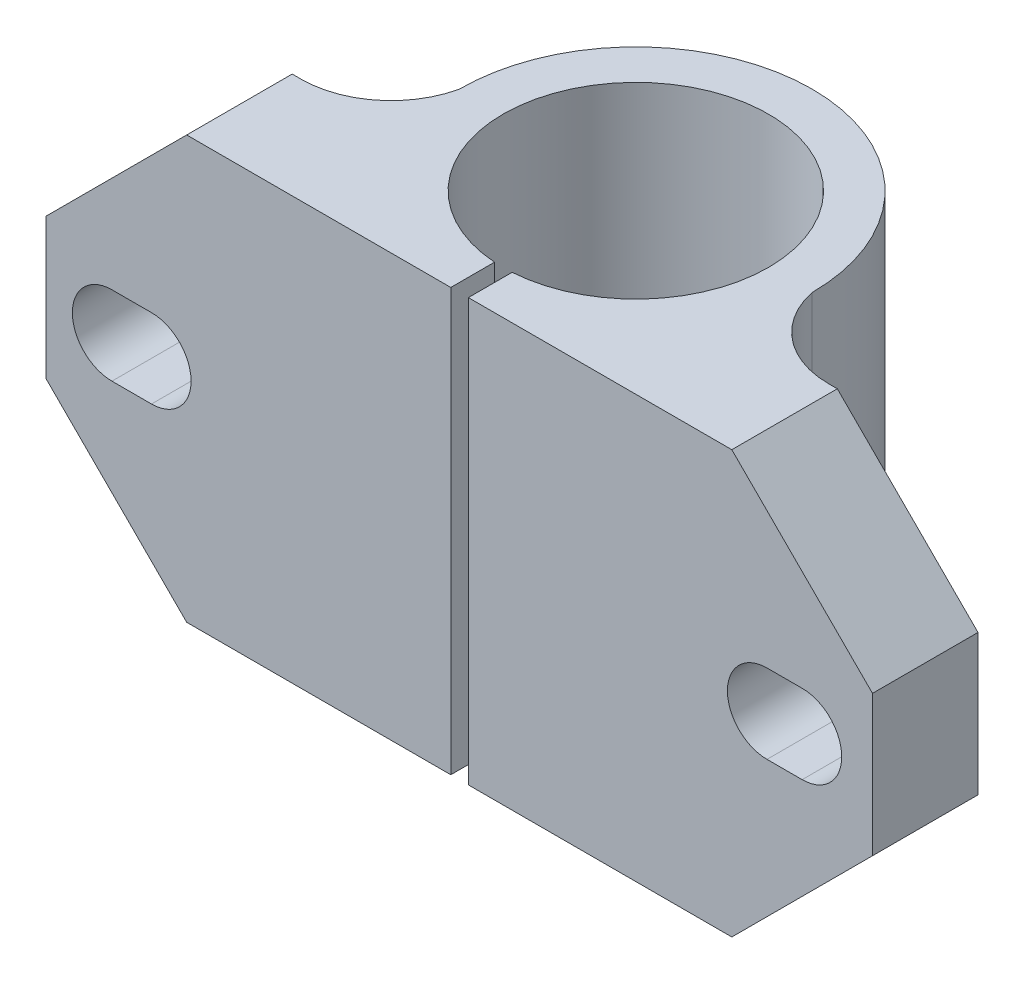
ISO-10303-21;
HEADER;
FILE_DESCRIPTION(('STEP AP214'),'2;1');
FILE_NAME('part.step','',(''),(''),'','','');
FILE_SCHEMA(('AUTOMOTIVE_DESIGN { 1 0 10303 214 1 1 1 1 }'));
ENDSEC;
DATA;
#1=APPLICATION_CONTEXT('core data for automotive mechanical design processes');
#2=APPLICATION_PROTOCOL_DEFINITION('international standard','automotive_design',2000,#1);
#3=PRODUCT_CONTEXT('',#1,'mechanical');
#4=PRODUCT('Part','Part','',(#3));
#5=PRODUCT_RELATED_PRODUCT_CATEGORY('part','',(#4));
#6=PRODUCT_DEFINITION_FORMATION('','',#4);
#7=PRODUCT_DEFINITION_CONTEXT('part definition',#1,'design');
#8=PRODUCT_DEFINITION('design','',#6,#7);
#9=PRODUCT_DEFINITION_SHAPE('','',#8);
#10=(LENGTH_UNIT() NAMED_UNIT(*) SI_UNIT(.MILLI.,.METRE.));
#11=(NAMED_UNIT(*) PLANE_ANGLE_UNIT() SI_UNIT($,.RADIAN.));
#12=(NAMED_UNIT(*) SI_UNIT($,.STERADIAN.) SOLID_ANGLE_UNIT());
#13=UNCERTAINTY_MEASURE_WITH_UNIT(LENGTH_MEASURE(1.E-05),#10,'distance_accuracy_value','');
#14=(GEOMETRIC_REPRESENTATION_CONTEXT(3) GLOBAL_UNCERTAINTY_ASSIGNED_CONTEXT((#13)) GLOBAL_UNIT_ASSIGNED_CONTEXT((#10,
#11,#12)) REPRESENTATION_CONTEXT('',''));
#15=CARTESIAN_POINT('',(0.,0.,0.));
#16=DIRECTION('',(0.,0.,1.));
#17=DIRECTION('',(1.,0.,0.));
#18=AXIS2_PLACEMENT_3D('',#15,#16,#17);
#19=CARTESIAN_POINT('',(0.,0.,0.));
#20=DIRECTION('',(0.,0.,1.));
#21=DIRECTION('',(1.,0.,0.));
#22=AXIS2_PLACEMENT_3D('',#19,#20,#21);
#23=PLANE('',#22);
#24=DIRECTION('',(-1.,0.,0.));
#25=VECTOR('',#24,1.);
#26=CARTESIAN_POINT('',(41.,14.25,0.));
#27=LINE('',#26,#25);
#28=CARTESIAN_POINT('',(43.,14.25,0.));
#29=VERTEX_POINT('',#28);
#30=CARTESIAN_POINT('',(41.,14.25,0.));
#31=VERTEX_POINT('',#30);
#32=EDGE_CURVE('E357',#29,#31,#27,.T.);
#33=ORIENTED_EDGE('',*,*,#32,.F.);
#34=CARTESIAN_POINT('',(43.,12.,0.));
#35=DIRECTION('',(0.,0.,1.));
#36=DIRECTION('',(1.,0.,0.));
#37=AXIS2_PLACEMENT_3D('',#34,#35,#36);
#38=CIRCLE('',#37,2.25);
#39=CARTESIAN_POINT('',(43.,9.74999999999999,0.));
#40=VERTEX_POINT('',#39);
#41=EDGE_CURVE('E373',#40,#29,#38,.T.);
#42=ORIENTED_EDGE('',*,*,#41,.F.);
#43=DIRECTION('',(1.,0.,0.));
#44=VECTOR('',#43,1.);
#45=CARTESIAN_POINT('',(41.,9.75000000000001,0.));
#46=LINE('',#45,#44);
#47=CARTESIAN_POINT('',(41.,9.75000000000001,0.));
#48=VERTEX_POINT('',#47);
#49=EDGE_CURVE('E376',#48,#40,#46,.T.);
#50=ORIENTED_EDGE('',*,*,#49,.F.);
#51=CARTESIAN_POINT('',(41.,12.,0.));
#52=DIRECTION('',(0.,0.,1.));
#53=DIRECTION('',(1.,0.,0.));
#54=AXIS2_PLACEMENT_3D('',#51,#52,#53);
#55=CIRCLE('',#54,2.25);
#56=EDGE_CURVE('E378',#31,#48,#55,.T.);
#57=ORIENTED_EDGE('',*,*,#56,.F.);
#58=EDGE_LOOP('',(#33,#42,#50,#57));
#59=FACE_BOUND('',#58,.T.);
#60=DIRECTION('',(1.,0.,0.));
#61=VECTOR('',#60,1.);
#62=CARTESIAN_POINT('',(0.,0.,0.));
#63=LINE('',#62,#61);
#64=CARTESIAN_POINT('',(24.0186333106229,0.,0.));
#65=VERTEX_POINT('',#64);
#66=CARTESIAN_POINT('',(38.9999999999999,0.,0.));
#67=VERTEX_POINT('',#66);
#68=EDGE_CURVE('E254',#65,#67,#63,.T.);
#69=ORIENTED_EDGE('',*,*,#68,.T.);
#70=DIRECTION('',(-0.707106781186549,-0.707106781186546,0.));
#71=VECTOR('',#70,1.);
#72=CARTESIAN_POINT('',(19.4999999999999,-19.5,0.));
#73=LINE('',#72,#71);
#74=CARTESIAN_POINT('',(47.,8.,0.));
#75=VERTEX_POINT('',#74);
#76=EDGE_CURVE('E331',#67,#75,#73,.F.);
#77=ORIENTED_EDGE('',*,*,#76,.T.);
#78=DIRECTION('',(0.,1.,0.));
#79=VECTOR('',#78,1.);
#80=CARTESIAN_POINT('',(47.,0.,0.));
#81=LINE('',#80,#79);
#82=CARTESIAN_POINT('',(47.,16.,0.));
#83=VERTEX_POINT('',#82);
#84=EDGE_CURVE('E301',#75,#83,#81,.T.);
#85=ORIENTED_EDGE('',*,*,#84,.T.);
#86=DIRECTION('',(-0.707106781186546,0.707106781186549,0.));
#87=VECTOR('',#86,1.);
#88=CARTESIAN_POINT('',(31.5000000000001,31.4999999999999,0.));
#89=LINE('',#88,#87);
#90=CARTESIAN_POINT('',(39.,24.,0.));
#91=VERTEX_POINT('',#90);
#92=EDGE_CURVE('E59',#83,#91,#89,.T.);
#93=ORIENTED_EDGE('',*,*,#92,.T.);
#94=DIRECTION('',(1.,0.,0.));
#95=VECTOR('',#94,1.);
#96=CARTESIAN_POINT('',(0.,24.,0.));
#97=LINE('',#96,#95);
#98=CARTESIAN_POINT('',(24.0186333106229,24.,0.));
#99=VERTEX_POINT('',#98);
#100=EDGE_CURVE('E243',#99,#91,#97,.T.);
#101=ORIENTED_EDGE('',*,*,#100,.F.);
#102=DIRECTION('',(0.,-1.,0.));
#103=VECTOR('',#102,1.);
#104=CARTESIAN_POINT('',(24.0186333106229,24.,0.));
#105=LINE('',#104,#103);
#106=EDGE_CURVE('E236',#99,#65,#105,.T.);
#107=ORIENTED_EDGE('',*,*,#106,.T.);
#108=EDGE_LOOP('',(#69,#77,#85,#93,#101,#107));
#109=FACE_BOUND('',#108,.T.);
#110=ADVANCED_FACE('F36',(#59,#109),#23,.T.);
#111=CARTESIAN_POINT('',(0.,0.,-6.));
#112=DIRECTION('',(-1.,0.,0.));
#113=DIRECTION('',(0.,0.,1.));
#114=AXIS2_PLACEMENT_3D('',#111,#112,#113);
#115=PLANE('',#114);
#116=DIRECTION('',(0.,1.,0.));
#117=VECTOR('',#116,1.);
#118=CARTESIAN_POINT('',(0.,0.,-6.));
#119=LINE('',#118,#117);
#120=CARTESIAN_POINT('',(0.,8.,-6.));
#121=VERTEX_POINT('',#120);
#122=CARTESIAN_POINT('',(0.,16.,-6.));
#123=VERTEX_POINT('',#122);
#124=EDGE_CURVE('E285',#121,#123,#119,.T.);
#125=ORIENTED_EDGE('',*,*,#124,.F.);
#126=DIRECTION('',(0.,0.,1.));
#127=VECTOR('',#126,1.);
#128=CARTESIAN_POINT('',(0.,8.,-6.));
#129=LINE('',#128,#127);
#130=CARTESIAN_POINT('',(0.,8.,0.));
#131=VERTEX_POINT('',#130);
#132=EDGE_CURVE('E306',#121,#131,#129,.T.);
#133=ORIENTED_EDGE('',*,*,#132,.T.);
#134=DIRECTION('',(0.,1.,0.));
#135=VECTOR('',#134,1.);
#136=CARTESIAN_POINT('',(0.,0.,0.));
#137=LINE('',#136,#135);
#138=CARTESIAN_POINT('',(0.,16.,0.));
#139=VERTEX_POINT('',#138);
#140=EDGE_CURVE('E268',#131,#139,#137,.T.);
#141=ORIENTED_EDGE('',*,*,#140,.T.);
#142=DIRECTION('',(0.,0.,-1.));
#143=VECTOR('',#142,1.);
#144=CARTESIAN_POINT('',(0.,16.,-6.));
#145=LINE('',#144,#143);
#146=EDGE_CURVE('E288',#139,#123,#145,.T.);
#147=ORIENTED_EDGE('',*,*,#146,.T.);
#148=EDGE_LOOP('',(#125,#133,#141,#147));
#149=FACE_BOUND('',#148,.T.);
#150=ADVANCED_FACE('F403',(#149),#115,.T.);
#151=CARTESIAN_POINT('',(8.50000000000001,0.,-6.));
#152=DIRECTION('',(0.,0.,-1.));
#153=DIRECTION('',(-1.,0.,0.));
#154=AXIS2_PLACEMENT_3D('',#151,#152,#153);
#155=PLANE('',#154);
#156=DIRECTION('',(-1.,0.,0.));
#157=VECTOR('',#156,1.);
#158=CARTESIAN_POINT('',(8.50000000000001,9.75000000000001,-6.));
#159=LINE('',#158,#157);
#160=CARTESIAN_POINT('',(6.,9.75000000000001,-6.00000000000001));
#161=VERTEX_POINT('',#160);
#162=CARTESIAN_POINT('',(3.74999999999994,9.75000000000001,-6.00000000000001));
#163=VERTEX_POINT('',#162);
#164=EDGE_CURVE('E382',#161,#163,#159,.T.);
#165=ORIENTED_EDGE('',*,*,#164,.F.);
#166=CARTESIAN_POINT('',(6.,12.,-6.00000000000001));
#167=DIRECTION('',(0.,0.,-1.));
#168=DIRECTION('',(-1.,0.,0.));
#169=AXIS2_PLACEMENT_3D('',#166,#167,#168);
#170=CIRCLE('',#169,2.25000000000007);
#171=CARTESIAN_POINT('',(6.,14.2500000000001,-6.00000000000001));
#172=VERTEX_POINT('',#171);
#173=EDGE_CURVE('E218',#172,#161,#170,.T.);
#174=ORIENTED_EDGE('',*,*,#173,.F.);
#175=DIRECTION('',(1.,0.,0.));
#176=VECTOR('',#175,1.);
#177=CARTESIAN_POINT('',(8.5,14.25,-6.));
#178=LINE('',#177,#176);
#179=CARTESIAN_POINT('',(3.74999999999994,14.25,-6.00000000000001));
#180=VERTEX_POINT('',#179);
#181=EDGE_CURVE('E51',#180,#172,#178,.T.);
#182=ORIENTED_EDGE('',*,*,#181,.F.);
#183=CARTESIAN_POINT('',(3.74999999999994,12.,-6.));
#184=DIRECTION('',(0.,0.,-1.));
#185=DIRECTION('',(-1.,0.,0.));
#186=AXIS2_PLACEMENT_3D('',#183,#184,#185);
#187=CIRCLE('',#186,2.25);
#188=EDGE_CURVE('E380',#163,#180,#187,.T.);
#189=ORIENTED_EDGE('',*,*,#188,.F.);
#190=EDGE_LOOP('',(#165,#174,#182,#189));
#191=FACE_BOUND('',#190,.T.);
#192=DIRECTION('',(-1.,0.,0.));
#193=VECTOR('',#192,1.);
#194=CARTESIAN_POINT('',(8.50000000000001,0.,-6.));
#195=LINE('',#194,#193);
#196=CARTESIAN_POINT('',(8.50000000000001,0.,-6.00000000000002));
#197=VERTEX_POINT('',#196);
#198=CARTESIAN_POINT('',(8.00000000000003,0.,-6.));
#199=VERTEX_POINT('',#198);
#200=EDGE_CURVE('E265',#197,#199,#195,.T.);
#201=ORIENTED_EDGE('',*,*,#200,.T.);
#202=DIRECTION('',(0.707106781186549,-0.707106781186546,0.));
#203=VECTOR('',#202,1.);
#204=CARTESIAN_POINT('',(8.25000000000002,-0.249999999999996,-6.));
#205=LINE('',#204,#203);
#206=EDGE_CURVE('E319',#199,#121,#205,.F.);
#207=ORIENTED_EDGE('',*,*,#206,.T.);
#208=ORIENTED_EDGE('',*,*,#124,.T.);
#209=DIRECTION('',(0.707106781186546,0.707106781186549,0.));
#210=VECTOR('',#209,1.);
#211=CARTESIAN_POINT('',(-3.75,12.25,-6.));
#212=LINE('',#211,#210);
#213=CARTESIAN_POINT('',(8.,24.,-6.));
#214=VERTEX_POINT('',#213);
#215=EDGE_CURVE('E317',#123,#214,#212,.T.);
#216=ORIENTED_EDGE('',*,*,#215,.T.);
#217=DIRECTION('',(-1.,0.,0.));
#218=VECTOR('',#217,1.);
#219=CARTESIAN_POINT('',(8.50000000000001,24.,-6.));
#220=LINE('',#219,#218);
#221=CARTESIAN_POINT('',(8.50000000000001,24.,-6.00000000000002));
#222=VERTEX_POINT('',#221);
#223=EDGE_CURVE('E282',#222,#214,#220,.T.);
#224=ORIENTED_EDGE('',*,*,#223,.F.);
#225=DIRECTION('',(0.,1.,0.));
#226=VECTOR('',#225,1.);
#227=CARTESIAN_POINT('',(8.50000000000001,0.,-6.00000000000002));
#228=LINE('',#227,#226);
#229=EDGE_CURVE('E289',#197,#222,#228,.T.);
#230=ORIENTED_EDGE('',*,*,#229,.F.);
#231=EDGE_LOOP('',(#201,#207,#208,#216,#224,#230));
#232=FACE_BOUND('',#231,.T.);
#233=ADVANCED_FACE('F399',(#191,#232),#155,.T.);
#234=CARTESIAN_POINT('',(8.50000000000001,0.,-11.1210427356607));
#235=DIRECTION('',(0.,1.,0.));
#236=DIRECTION('',(0.,0.,1.));
#237=AXIS2_PLACEMENT_3D('',#234,#235,#236);
#238=CYLINDRICAL_SURFACE('',#237,5.12104273566066);
#239=CARTESIAN_POINT('',(8.50000000000001,24.,-11.1210427356607));
#240=DIRECTION('',(0.,-1.,0.));
#241=DIRECTION('',(0.,0.,-1.));
#242=AXIS2_PLACEMENT_3D('',#239,#240,#241);
#243=CIRCLE('',#242,5.12104273566066);
#244=CARTESIAN_POINT('',(13.4959473897421,24.,-9.99605901160399));
#245=VERTEX_POINT('',#244);
#246=EDGE_CURVE('E279',#245,#222,#243,.T.);
#247=ORIENTED_EDGE('',*,*,#246,.F.);
#248=DIRECTION('',(0.,1.,0.));
#249=VECTOR('',#248,1.);
#250=CARTESIAN_POINT('',(13.4959473897421,0.,-9.99605901160399));
#251=LINE('',#250,#249);
#252=CARTESIAN_POINT('',(13.4959473897421,0.,-9.99605901160399));
#253=VERTEX_POINT('',#252);
#254=EDGE_CURVE('E291',#253,#245,#251,.T.);
#255=ORIENTED_EDGE('',*,*,#254,.F.);
#256=CARTESIAN_POINT('',(8.50000000000001,0.,-11.1210427356607));
#257=DIRECTION('',(0.,-1.,0.));
#258=DIRECTION('',(0.,0.,-1.));
#259=AXIS2_PLACEMENT_3D('',#256,#257,#258);
#260=CIRCLE('',#259,5.12104273566066);
#261=EDGE_CURVE('E262',#253,#197,#260,.T.);
#262=ORIENTED_EDGE('',*,*,#261,.T.);
#263=ORIENTED_EDGE('',*,*,#229,.T.);
#264=EDGE_LOOP('',(#247,#255,#262,#263));
#265=FACE_BOUND('',#264,.T.);
#266=ADVANCED_FACE('F402',(#265),#238,.F.);
#267=CARTESIAN_POINT('',(23.5186333106229,0.,-10.0227213844719));
#268=DIRECTION('',(0.,1.,0.));
#269=DIRECTION('',(0.,0.,1.));
#270=AXIS2_PLACEMENT_3D('',#267,#268,#269);
#271=CYLINDRICAL_SURFACE('',#270,10.0227213844719);
#272=CARTESIAN_POINT('',(23.5186333106229,24.,-10.0227213844719));
#273=DIRECTION('',(0.,1.,0.));
#274=DIRECTION('',(0.,0.,1.));
#275=AXIS2_PLACEMENT_3D('',#272,#273,#274);
#276=CIRCLE('',#275,10.0227213844719);
#277=CARTESIAN_POINT('',(33.5413546555968,24.,-10.021831577252));
#278=VERTEX_POINT('',#277);
#279=EDGE_CURVE('E276',#278,#245,#276,.T.);
#280=ORIENTED_EDGE('',*,*,#279,.F.);
#281=DIRECTION('',(0.,1.,0.));
#282=VECTOR('',#281,1.);
#283=CARTESIAN_POINT('',(33.5413546555968,0.,-10.021831577252));
#284=LINE('',#283,#282);
#285=CARTESIAN_POINT('',(33.5413546555968,0.,-10.021831577252));
#286=VERTEX_POINT('',#285);
#287=EDGE_CURVE('E293',#286,#278,#284,.T.);
#288=ORIENTED_EDGE('',*,*,#287,.F.);
#289=CARTESIAN_POINT('',(23.5186333106229,0.,-10.0227213844719));
#290=DIRECTION('',(0.,1.,0.));
#291=DIRECTION('',(0.,0.,1.));
#292=AXIS2_PLACEMENT_3D('',#289,#290,#291);
#293=CIRCLE('',#292,10.0227213844719);
#294=EDGE_CURVE('E259',#286,#253,#293,.T.);
#295=ORIENTED_EDGE('',*,*,#294,.T.);
#296=ORIENTED_EDGE('',*,*,#254,.T.);
#297=EDGE_LOOP('',(#280,#288,#295,#296));
#298=FACE_BOUND('',#297,.T.);
#299=ADVANCED_FACE('F435',(#298),#271,.T.);
#300=CARTESIAN_POINT('',(38.5000000000001,0.,-11.0677523541657));
#301=DIRECTION('',(0.,1.,0.));
#302=DIRECTION('',(0.,0.,1.));
#303=AXIS2_PLACEMENT_3D('',#300,#301,#302);
#304=CYLINDRICAL_SURFACE('',#303,5.06775235416579);
#305=CARTESIAN_POINT('',(38.5000000000001,24.,-11.0677523541657));
#306=DIRECTION('',(0.,-1.,0.));
#307=DIRECTION('',(0.,0.,-1.));
#308=AXIS2_PLACEMENT_3D('',#305,#306,#307);
#309=CIRCLE('',#308,5.06775235416579);
#310=CARTESIAN_POINT('',(38.5,24.,-6.00000000000001));
#311=VERTEX_POINT('',#310);
#312=EDGE_CURVE('E273',#311,#278,#309,.T.);
#313=ORIENTED_EDGE('',*,*,#312,.F.);
#314=DIRECTION('',(0.,1.,0.));
#315=VECTOR('',#314,1.);
#316=CARTESIAN_POINT('',(38.5,0.,-6.00000000000001));
#317=LINE('',#316,#315);
#318=CARTESIAN_POINT('',(38.5,0.,-6.00000000000001));
#319=VERTEX_POINT('',#318);
#320=EDGE_CURVE('E295',#319,#311,#317,.T.);
#321=ORIENTED_EDGE('',*,*,#320,.F.);
#322=CARTESIAN_POINT('',(38.5000000000001,0.,-11.0677523541657));
#323=DIRECTION('',(0.,-1.,0.));
#324=DIRECTION('',(0.,0.,-1.));
#325=AXIS2_PLACEMENT_3D('',#322,#323,#324);
#326=CIRCLE('',#325,5.06775235416579);
#327=EDGE_CURVE('E256',#319,#286,#326,.T.);
#328=ORIENTED_EDGE('',*,*,#327,.T.);
#329=ORIENTED_EDGE('',*,*,#287,.T.);
#330=EDGE_LOOP('',(#313,#321,#328,#329));
#331=FACE_BOUND('',#330,.T.);
#332=ADVANCED_FACE('F438',(#331),#304,.F.);
#333=CARTESIAN_POINT('',(47.,0.,-6.));
#334=DIRECTION('',(0.,0.,-1.));
#335=DIRECTION('',(-1.,0.,0.));
#336=AXIS2_PLACEMENT_3D('',#333,#334,#335);
#337=PLANE('',#336);
#338=CARTESIAN_POINT('',(41.,12.,-6.00000000000001));
#339=DIRECTION('',(0.,0.,-1.));
#340=DIRECTION('',(-1.,0.,0.));
#341=AXIS2_PLACEMENT_3D('',#338,#339,#340);
#342=CIRCLE('',#341,2.25);
#343=CARTESIAN_POINT('',(41.,9.75000000000001,-6.00000000000001));
#344=VERTEX_POINT('',#343);
#345=CARTESIAN_POINT('',(41.,14.25,-6.00000000000001));
#346=VERTEX_POINT('',#345);
#347=EDGE_CURVE('E206',#344,#346,#342,.T.);
#348=ORIENTED_EDGE('',*,*,#347,.F.);
#349=DIRECTION('',(-1.,0.,0.));
#350=VECTOR('',#349,1.);
#351=CARTESIAN_POINT('',(47.,9.75000000000001,-6.));
#352=LINE('',#351,#350);
#353=CARTESIAN_POINT('',(43.,9.74999999999999,-6.00000000000001));
#354=VERTEX_POINT('',#353);
#355=EDGE_CURVE('E359',#354,#344,#352,.T.);
#356=ORIENTED_EDGE('',*,*,#355,.F.);
#357=CARTESIAN_POINT('',(43.,12.,-6.00000000000001));
#358=DIRECTION('',(0.,0.,-1.));
#359=DIRECTION('',(-1.,0.,0.));
#360=AXIS2_PLACEMENT_3D('',#357,#358,#359);
#361=CIRCLE('',#360,2.25);
#362=CARTESIAN_POINT('',(43.,14.25,-6.00000000000001));
#363=VERTEX_POINT('',#362);
#364=EDGE_CURVE('E339',#363,#354,#361,.T.);
#365=ORIENTED_EDGE('',*,*,#364,.F.);
#366=DIRECTION('',(1.,0.,0.));
#367=VECTOR('',#366,1.);
#368=CARTESIAN_POINT('',(47.,14.25,-6.));
#369=LINE('',#368,#367);
#370=EDGE_CURVE('E222',#346,#363,#369,.T.);
#371=ORIENTED_EDGE('',*,*,#370,.F.);
#372=EDGE_LOOP('',(#348,#356,#365,#371));
#373=FACE_BOUND('',#372,.T.);
#374=DIRECTION('',(0.,1.,0.));
#375=VECTOR('',#374,1.);
#376=CARTESIAN_POINT('',(47.,0.,-6.));
#377=LINE('',#376,#375);
#378=CARTESIAN_POINT('',(47.,8.,-6.));
#379=VERTEX_POINT('',#378);
#380=CARTESIAN_POINT('',(47.,16.,-6.));
#381=VERTEX_POINT('',#380);
#382=EDGE_CURVE('E298',#379,#381,#377,.T.);
#383=ORIENTED_EDGE('',*,*,#382,.F.);
#384=DIRECTION('',(0.707106781186549,0.707106781186546,0.));
#385=VECTOR('',#384,1.);
#386=CARTESIAN_POINT('',(43.,4.00000000000001,-6.));
#387=LINE('',#386,#385);
#388=CARTESIAN_POINT('',(38.9999999999999,0.,-6.00000000000001));
#389=VERTEX_POINT('',#388);
#390=EDGE_CURVE('E328',#379,#389,#387,.F.);
#391=ORIENTED_EDGE('',*,*,#390,.T.);
#392=DIRECTION('',(-1.,0.,0.));
#393=VECTOR('',#392,1.);
#394=CARTESIAN_POINT('',(47.,0.,-6.));
#395=LINE('',#394,#393);
#396=EDGE_CURVE('E253',#389,#319,#395,.T.);
#397=ORIENTED_EDGE('',*,*,#396,.T.);
#398=ORIENTED_EDGE('',*,*,#320,.T.);
#399=DIRECTION('',(-1.,0.,0.));
#400=VECTOR('',#399,1.);
#401=CARTESIAN_POINT('',(47.,24.,-6.));
#402=LINE('',#401,#400);
#403=CARTESIAN_POINT('',(39.,24.,-6.00000000000001));
#404=VERTEX_POINT('',#403);
#405=EDGE_CURVE('E271',#404,#311,#402,.T.);
#406=ORIENTED_EDGE('',*,*,#405,.F.);
#407=DIRECTION('',(0.707106781186546,-0.707106781186549,0.));
#408=VECTOR('',#407,1.);
#409=CARTESIAN_POINT('',(55.,7.99999999999996,-6.));
#410=LINE('',#409,#408);
#411=EDGE_CURVE('E326',#404,#381,#410,.T.);
#412=ORIENTED_EDGE('',*,*,#411,.T.);
#413=EDGE_LOOP('',(#383,#391,#397,#398,#406,#412));
#414=FACE_BOUND('',#413,.T.);
#415=ADVANCED_FACE('F363',(#373,#414),#337,.T.);
#416=CARTESIAN_POINT('',(47.,0.,0.));
#417=DIRECTION('',(1.,0.,0.));
#418=DIRECTION('',(0.,0.,-1.));
#419=AXIS2_PLACEMENT_3D('',#416,#417,#418);
#420=PLANE('',#419);
#421=ORIENTED_EDGE('',*,*,#84,.F.);
#422=DIRECTION('',(0.,0.,-1.));
#423=VECTOR('',#422,1.);
#424=CARTESIAN_POINT('',(47.,8.,0.));
#425=LINE('',#424,#423);
#426=EDGE_CURVE('E323',#75,#379,#425,.T.);
#427=ORIENTED_EDGE('',*,*,#426,.T.);
#428=ORIENTED_EDGE('',*,*,#382,.T.);
#429=DIRECTION('',(0.,0.,1.));
#430=VECTOR('',#429,1.);
#431=CARTESIAN_POINT('',(47.,16.,0.));
#432=LINE('',#431,#430);
#433=EDGE_CURVE('E321',#381,#83,#432,.T.);
#434=ORIENTED_EDGE('',*,*,#433,.T.);
#435=EDGE_LOOP('',(#421,#427,#428,#434));
#436=FACE_BOUND('',#435,.T.);
#437=ADVANCED_FACE('F450',(#436),#420,.T.);
#438=DIRECTION('',(1.,0.,0.));
#439=VECTOR('',#438,1.);
#440=CARTESIAN_POINT('',(6.,9.75000000000001,0.));
#441=LINE('',#440,#439);
#442=CARTESIAN_POINT('',(3.74999999999994,9.75000000000001,0.));
#443=VERTEX_POINT('',#442);
#444=CARTESIAN_POINT('',(6.,9.75000000000001,0.));
#445=VERTEX_POINT('',#444);
#446=EDGE_CURVE('E388',#443,#445,#441,.T.);
#447=ORIENTED_EDGE('',*,*,#446,.F.);
#448=CARTESIAN_POINT('',(3.74999999999994,12.,0.));
#449=DIRECTION('',(0.,0.,1.));
#450=DIRECTION('',(1.,0.,0.));
#451=AXIS2_PLACEMENT_3D('',#448,#449,#450);
#452=CIRCLE('',#451,2.25);
#453=CARTESIAN_POINT('',(3.74999999999994,14.25,0.));
#454=VERTEX_POINT('',#453);
#455=EDGE_CURVE('E214',#454,#443,#452,.T.);
#456=ORIENTED_EDGE('',*,*,#455,.F.);
#457=DIRECTION('',(-1.,0.,0.));
#458=VECTOR('',#457,1.);
#459=CARTESIAN_POINT('',(6.,14.25,0.));
#460=LINE('',#459,#458);
#461=CARTESIAN_POINT('',(6.,14.25,0.));
#462=VERTEX_POINT('',#461);
#463=EDGE_CURVE('E200',#462,#454,#460,.T.);
#464=ORIENTED_EDGE('',*,*,#463,.F.);
#465=CARTESIAN_POINT('',(6.,12.,0.));
#466=DIRECTION('',(0.,0.,-1.));
#467=DIRECTION('',(-1.,0.,0.));
#468=AXIS2_PLACEMENT_3D('',#465,#466,#467);
#469=CIRCLE('',#468,2.25000000000007);
#470=EDGE_CURVE('E212',#462,#445,#469,.T.);
#471=ORIENTED_EDGE('',*,*,#470,.T.);
#472=EDGE_LOOP('',(#447,#456,#464,#471));
#473=FACE_BOUND('',#472,.T.);
#474=ORIENTED_EDGE('',*,*,#140,.F.);
#475=DIRECTION('',(-0.707106781186549,0.707106781186546,0.));
#476=VECTOR('',#475,1.);
#477=CARTESIAN_POINT('',(4.,4.00000000000001,0.));
#478=LINE('',#477,#476);
#479=CARTESIAN_POINT('',(8.00000000000002,0.,0.));
#480=VERTEX_POINT('',#479);
#481=EDGE_CURVE('E311',#131,#480,#478,.F.);
#482=ORIENTED_EDGE('',*,*,#481,.T.);
#483=CARTESIAN_POINT('',(23.0186333106229,0.,0.));
#484=VERTEX_POINT('',#483);
#485=EDGE_CURVE('E251',#480,#484,#63,.T.);
#486=ORIENTED_EDGE('',*,*,#485,.T.);
#487=DIRECTION('',(0.,-1.,0.));
#488=VECTOR('',#487,1.);
#489=CARTESIAN_POINT('',(23.0186333106229,24.,0.));
#490=LINE('',#489,#488);
#491=CARTESIAN_POINT('',(23.0186333106229,24.,0.));
#492=VERTEX_POINT('',#491);
#493=EDGE_CURVE('E246',#492,#484,#490,.T.);
#494=ORIENTED_EDGE('',*,*,#493,.F.);
#495=CARTESIAN_POINT('',(8.,24.,0.));
#496=VERTEX_POINT('',#495);
#497=EDGE_CURVE('E269',#496,#492,#97,.T.);
#498=ORIENTED_EDGE('',*,*,#497,.F.);
#499=DIRECTION('',(-0.707106781186546,-0.707106781186549,0.));
#500=VECTOR('',#499,1.);
#501=CARTESIAN_POINT('',(-7.99999999999999,7.99999999999996,0.));
#502=LINE('',#501,#500);
#503=EDGE_CURVE('E309',#496,#139,#502,.T.);
#504=ORIENTED_EDGE('',*,*,#503,.T.);
#505=EDGE_LOOP('',(#474,#482,#486,#494,#498,#504));
#506=FACE_BOUND('',#505,.T.);
#507=ADVANCED_FACE('F210',(#473,#506),#23,.T.);
#508=CARTESIAN_POINT('',(38.5000000000001,0.,-11.0677523541657));
#509=DIRECTION('',(0.,-1.,0.));
#510=DIRECTION('',(0.,0.,-1.));
#511=AXIS2_PLACEMENT_3D('',#508,#509,#510);
#512=PLANE('',#511);
#513=ORIENTED_EDGE('',*,*,#485,.F.);
#514=DIRECTION('',(0.,0.,-1.));
#515=VECTOR('',#514,1.);
#516=CARTESIAN_POINT('',(8.00000000000003,0.,-11.0677523541657));
#517=LINE('',#516,#515);
#518=EDGE_CURVE('E315',#480,#199,#517,.T.);
#519=ORIENTED_EDGE('',*,*,#518,.T.);
#520=ORIENTED_EDGE('',*,*,#200,.F.);
#521=ORIENTED_EDGE('',*,*,#261,.F.);
#522=ORIENTED_EDGE('',*,*,#294,.F.);
#523=ORIENTED_EDGE('',*,*,#327,.F.);
#524=ORIENTED_EDGE('',*,*,#396,.F.);
#525=DIRECTION('',(0.,0.,1.));
#526=VECTOR('',#525,1.);
#527=CARTESIAN_POINT('',(38.9999999999999,0.,-11.0677523541657));
#528=LINE('',#527,#526);
#529=EDGE_CURVE('E313',#389,#67,#528,.T.);
#530=ORIENTED_EDGE('',*,*,#529,.T.);
#531=ORIENTED_EDGE('',*,*,#68,.F.);
#532=DIRECTION('',(0.,0.,1.));
#533=VECTOR('',#532,1.);
#534=CARTESIAN_POINT('',(24.0186333106229,0.,-2.48929586881175));
#535=LINE('',#534,#533);
#536=CARTESIAN_POINT('',(24.0186333106229,0.,-2.48929586881175));
#537=VERTEX_POINT('',#536);
#538=EDGE_CURVE('E228',#537,#65,#535,.T.);
#539=ORIENTED_EDGE('',*,*,#538,.F.);
#540=CARTESIAN_POINT('',(23.5186333106229,0.,-10.022721384472));
#541=DIRECTION('',(0.,1.,0.));
#542=DIRECTION('',(0.,0.,1.));
#543=AXIS2_PLACEMENT_3D('',#540,#541,#542);
#544=CIRCLE('',#543,7.55000000000005);
#545=CARTESIAN_POINT('',(23.0186333106229,0.,-2.48929586881175));
#546=VERTEX_POINT('',#545);
#547=EDGE_CURVE('E220',#537,#546,#544,.T.);
#548=ORIENTED_EDGE('',*,*,#547,.T.);
#549=DIRECTION('',(0.,0.,-1.));
#550=VECTOR('',#549,1.);
#551=CARTESIAN_POINT('',(23.0186333106229,0.,0.));
#552=LINE('',#551,#550);
#553=EDGE_CURVE('E233',#484,#546,#552,.T.);
#554=ORIENTED_EDGE('',*,*,#553,.F.);
#555=EDGE_LOOP('',(#513,#519,#520,#521,#522,#523,#524,#530,#531,#539,#548,#554));
#556=FACE_BOUND('',#555,.T.);
#557=ADVANCED_FACE('F432',(#556),#512,.T.);
#558=CARTESIAN_POINT('',(38.5000000000001,24.,-11.0677523541657));
#559=DIRECTION('',(0.,-1.,0.));
#560=DIRECTION('',(0.,0.,-1.));
#561=AXIS2_PLACEMENT_3D('',#558,#559,#560);
#562=PLANE('',#561);
#563=ORIENTED_EDGE('',*,*,#223,.T.);
#564=DIRECTION('',(0.,0.,1.));
#565=VECTOR('',#564,1.);
#566=CARTESIAN_POINT('',(8.,24.,0.));
#567=LINE('',#566,#565);
#568=EDGE_CURVE('E336',#214,#496,#567,.T.);
#569=ORIENTED_EDGE('',*,*,#568,.T.);
#570=ORIENTED_EDGE('',*,*,#497,.T.);
#571=DIRECTION('',(0.,0.,-1.));
#572=VECTOR('',#571,1.);
#573=CARTESIAN_POINT('',(23.0186333106229,24.,0.));
#574=LINE('',#573,#572);
#575=CARTESIAN_POINT('',(23.0186333106229,24.,-2.48929586881175));
#576=VERTEX_POINT('',#575);
#577=EDGE_CURVE('E232',#492,#576,#574,.T.);
#578=ORIENTED_EDGE('',*,*,#577,.T.);
#579=CARTESIAN_POINT('',(23.5186333106229,24.,-10.022721384472));
#580=DIRECTION('',(0.,1.,0.));
#581=DIRECTION('',(0.,0.,1.));
#582=AXIS2_PLACEMENT_3D('',#579,#580,#581);
#583=CIRCLE('',#582,7.55000000000005);
#584=CARTESIAN_POINT('',(24.0186333106229,24.,-2.48929586881175));
#585=VERTEX_POINT('',#584);
#586=EDGE_CURVE('E217',#585,#576,#583,.T.);
#587=ORIENTED_EDGE('',*,*,#586,.F.);
#588=DIRECTION('',(0.,0.,1.));
#589=VECTOR('',#588,1.);
#590=CARTESIAN_POINT('',(24.0186333106229,24.,-2.48929586881175));
#591=LINE('',#590,#589);
#592=EDGE_CURVE('E229',#585,#99,#591,.T.);
#593=ORIENTED_EDGE('',*,*,#592,.T.);
#594=ORIENTED_EDGE('',*,*,#100,.T.);
#595=DIRECTION('',(0.,0.,-1.));
#596=VECTOR('',#595,1.);
#597=CARTESIAN_POINT('',(39.,24.,-6.));
#598=LINE('',#597,#596);
#599=EDGE_CURVE('E333',#91,#404,#598,.T.);
#600=ORIENTED_EDGE('',*,*,#599,.T.);
#601=ORIENTED_EDGE('',*,*,#405,.T.);
#602=ORIENTED_EDGE('',*,*,#312,.T.);
#603=ORIENTED_EDGE('',*,*,#279,.T.);
#604=ORIENTED_EDGE('',*,*,#246,.T.);
#605=EDGE_LOOP('',(#563,#569,#570,#578,#587,#593,#594,#600,#601,#602,#603,#604));
#606=FACE_BOUND('',#605,.T.);
#607=ADVANCED_FACE('F426',(#606),#562,.F.);
#608=CARTESIAN_POINT('',(24.0186333106229,24.,-2.48929586881175));
#609=DIRECTION('',(1.,0.,0.));
#610=DIRECTION('',(0.,0.,-1.));
#611=AXIS2_PLACEMENT_3D('',#608,#609,#610);
#612=PLANE('',#611);
#613=ORIENTED_EDGE('',*,*,#538,.T.);
#614=ORIENTED_EDGE('',*,*,#106,.F.);
#615=ORIENTED_EDGE('',*,*,#592,.F.);
#616=DIRECTION('',(0.,-1.,0.));
#617=VECTOR('',#616,1.);
#618=CARTESIAN_POINT('',(24.0186333106229,24.,-2.48929586881175));
#619=LINE('',#618,#617);
#620=EDGE_CURVE('E240',#585,#537,#619,.T.);
#621=ORIENTED_EDGE('',*,*,#620,.T.);
#622=EDGE_LOOP('',(#613,#614,#615,#621));
#623=FACE_BOUND('',#622,.T.);
#624=ADVANCED_FACE('F481',(#623),#612,.F.);
#625=CARTESIAN_POINT('',(23.0186333106229,24.,0.));
#626=DIRECTION('',(-1.,0.,0.));
#627=DIRECTION('',(0.,0.,1.));
#628=AXIS2_PLACEMENT_3D('',#625,#626,#627);
#629=PLANE('',#628);
#630=ORIENTED_EDGE('',*,*,#553,.T.);
#631=DIRECTION('',(0.,-1.,0.));
#632=VECTOR('',#631,1.);
#633=CARTESIAN_POINT('',(23.0186333106229,24.,-2.48929586881175));
#634=LINE('',#633,#632);
#635=EDGE_CURVE('E244',#576,#546,#634,.T.);
#636=ORIENTED_EDGE('',*,*,#635,.F.);
#637=ORIENTED_EDGE('',*,*,#577,.F.);
#638=ORIENTED_EDGE('',*,*,#493,.T.);
#639=EDGE_LOOP('',(#630,#636,#637,#638));
#640=FACE_BOUND('',#639,.T.);
#641=ADVANCED_FACE('F535',(#640),#629,.F.);
#642=CARTESIAN_POINT('',(23.5186333106229,0.,-10.022721384472));
#643=DIRECTION('',(0.,1.,0.));
#644=DIRECTION('',(0.,0.,1.));
#645=AXIS2_PLACEMENT_3D('',#642,#643,#644);
#646=CYLINDRICAL_SURFACE('',#645,7.55000000000005);
#647=ORIENTED_EDGE('',*,*,#586,.T.);
#648=ORIENTED_EDGE('',*,*,#635,.T.);
#649=ORIENTED_EDGE('',*,*,#547,.F.);
#650=ORIENTED_EDGE('',*,*,#620,.F.);
#651=EDGE_LOOP('',(#647,#648,#649,#650));
#652=FACE_BOUND('',#651,.T.);
#653=ADVANCED_FACE('F543',(#652),#646,.F.);
#654=CARTESIAN_POINT('',(6.,12.,-6.00000000000001));
#655=DIRECTION('',(0.,0.,-1.));
#656=DIRECTION('',(-1.,0.,0.));
#657=AXIS2_PLACEMENT_3D('',#654,#655,#656);
#658=CYLINDRICAL_SURFACE('',#657,2.25000000000007);
#659=ORIENTED_EDGE('',*,*,#173,.T.);
#660=DIRECTION('',(0.,0.,-1.));
#661=VECTOR('',#660,1.);
#662=CARTESIAN_POINT('',(6.,9.74999999999997,-6.00000000000001));
#663=LINE('',#662,#661);
#664=EDGE_CURVE('E11',#161,#445,#663,.F.);
#665=ORIENTED_EDGE('',*,*,#664,.T.);
#666=ORIENTED_EDGE('',*,*,#470,.F.);
#667=DIRECTION('',(0.,0.,-1.));
#668=VECTOR('',#667,1.);
#669=CARTESIAN_POINT('',(6.,14.25,-6.00000000000001));
#670=LINE('',#669,#668);
#671=EDGE_CURVE('E44',#172,#462,#670,.F.);
#672=ORIENTED_EDGE('',*,*,#671,.F.);
#673=EDGE_LOOP('',(#659,#665,#666,#672));
#674=FACE_BOUND('',#673,.T.);
#675=ADVANCED_FACE('F216',(#674),#658,.F.);
#676=CARTESIAN_POINT('',(0.,8.,-6.));
#677=DIRECTION('',(0.707106781186546,0.707106781186549,0.));
#678=DIRECTION('',(0.,0.,1.));
#679=AXIS2_PLACEMENT_3D('',#676,#677,#678);
#680=PLANE('',#679);
#681=ORIENTED_EDGE('',*,*,#206,.F.);
#682=ORIENTED_EDGE('',*,*,#518,.F.);
#683=ORIENTED_EDGE('',*,*,#481,.F.);
#684=ORIENTED_EDGE('',*,*,#132,.F.);
#685=EDGE_LOOP('',(#681,#682,#683,#684));
#686=FACE_BOUND('',#685,.T.);
#687=ADVANCED_FACE('F414',(#686),#680,.F.);
#688=CARTESIAN_POINT('',(47.,8.,0.));
#689=DIRECTION('',(-0.707106781186546,0.707106781186549,0.));
#690=DIRECTION('',(0.,0.,-1.));
#691=AXIS2_PLACEMENT_3D('',#688,#689,#690);
#692=PLANE('',#691);
#693=ORIENTED_EDGE('',*,*,#76,.F.);
#694=ORIENTED_EDGE('',*,*,#529,.F.);
#695=ORIENTED_EDGE('',*,*,#390,.F.);
#696=ORIENTED_EDGE('',*,*,#426,.F.);
#697=EDGE_LOOP('',(#693,#694,#695,#696));
#698=FACE_BOUND('',#697,.T.);
#699=ADVANCED_FACE('F446',(#698),#692,.F.);
#700=CARTESIAN_POINT('',(8.,24.,-11.0677523541657));
#701=DIRECTION('',(-0.707106781186549,0.707106781186546,0.));
#702=DIRECTION('',(0.,0.,-1.));
#703=AXIS2_PLACEMENT_3D('',#700,#701,#702);
#704=PLANE('',#703);
#705=ORIENTED_EDGE('',*,*,#215,.F.);
#706=ORIENTED_EDGE('',*,*,#146,.F.);
#707=ORIENTED_EDGE('',*,*,#503,.F.);
#708=ORIENTED_EDGE('',*,*,#568,.F.);
#709=EDGE_LOOP('',(#705,#706,#707,#708));
#710=FACE_BOUND('',#709,.T.);
#711=ADVANCED_FACE('F424',(#710),#704,.T.);
#712=CARTESIAN_POINT('',(39.,24.,-11.0677523541657));
#713=DIRECTION('',(0.707106781186549,0.707106781186546,0.));
#714=DIRECTION('',(0.,0.,1.));
#715=AXIS2_PLACEMENT_3D('',#712,#713,#714);
#716=PLANE('',#715);
#717=ORIENTED_EDGE('',*,*,#92,.F.);
#718=ORIENTED_EDGE('',*,*,#433,.F.);
#719=ORIENTED_EDGE('',*,*,#411,.F.);
#720=ORIENTED_EDGE('',*,*,#599,.F.);
#721=EDGE_LOOP('',(#717,#718,#719,#720));
#722=FACE_BOUND('',#721,.T.);
#723=ADVANCED_FACE('F38',(#722),#716,.T.);
#724=CARTESIAN_POINT('',(41.,14.25,-20.0454427689438));
#725=DIRECTION('',(0.,1.,0.));
#726=DIRECTION('',(0.,0.,1.));
#727=AXIS2_PLACEMENT_3D('',#724,#725,#726);
#728=PLANE('',#727);
#729=ORIENTED_EDGE('',*,*,#370,.T.);
#730=DIRECTION('',(0.,0.,1.));
#731=VECTOR('',#730,1.);
#732=CARTESIAN_POINT('',(43.,14.25,-20.0454427689438));
#733=LINE('',#732,#731);
#734=EDGE_CURVE('E360',#363,#29,#733,.T.);
#735=ORIENTED_EDGE('',*,*,#734,.T.);
#736=ORIENTED_EDGE('',*,*,#32,.T.);
#737=DIRECTION('',(0.,0.,1.));
#738=VECTOR('',#737,1.);
#739=CARTESIAN_POINT('',(41.,14.25,-20.0454427689438));
#740=LINE('',#739,#738);
#741=EDGE_CURVE('E347',#346,#31,#740,.T.);
#742=ORIENTED_EDGE('',*,*,#741,.F.);
#743=EDGE_LOOP('',(#729,#735,#736,#742));
#744=FACE_BOUND('',#743,.T.);
#745=ADVANCED_FACE('F354',(#744),#728,.F.);
#746=CARTESIAN_POINT('',(41.,9.75000000000001,-20.0454427689438));
#747=DIRECTION('',(0.,-1.,0.));
#748=DIRECTION('',(0.,0.,-1.));
#749=AXIS2_PLACEMENT_3D('',#746,#747,#748);
#750=PLANE('',#749);
#751=ORIENTED_EDGE('',*,*,#355,.T.);
#752=DIRECTION('',(0.,0.,1.));
#753=VECTOR('',#752,1.);
#754=CARTESIAN_POINT('',(41.,9.75000000000001,-20.0454427689438));
#755=LINE('',#754,#753);
#756=EDGE_CURVE('E349',#344,#48,#755,.T.);
#757=ORIENTED_EDGE('',*,*,#756,.T.);
#758=ORIENTED_EDGE('',*,*,#49,.T.);
#759=DIRECTION('',(0.,0.,1.));
#760=VECTOR('',#759,1.);
#761=CARTESIAN_POINT('',(43.,9.74999999999999,-20.0454427689438));
#762=LINE('',#761,#760);
#763=EDGE_CURVE('E368',#354,#40,#762,.T.);
#764=ORIENTED_EDGE('',*,*,#763,.F.);
#765=EDGE_LOOP('',(#751,#757,#758,#764));
#766=FACE_BOUND('',#765,.T.);
#767=ADVANCED_FACE('F589',(#766),#750,.F.);
#768=CARTESIAN_POINT('',(41.,12.,-20.0454427689438));
#769=DIRECTION('',(0.,0.,1.));
#770=DIRECTION('',(1.,0.,0.));
#771=AXIS2_PLACEMENT_3D('',#768,#769,#770);
#772=CYLINDRICAL_SURFACE('',#771,2.25);
#773=ORIENTED_EDGE('',*,*,#347,.T.);
#774=ORIENTED_EDGE('',*,*,#741,.T.);
#775=ORIENTED_EDGE('',*,*,#56,.T.);
#776=ORIENTED_EDGE('',*,*,#756,.F.);
#777=EDGE_LOOP('',(#773,#774,#775,#776));
#778=FACE_BOUND('',#777,.T.);
#779=ADVANCED_FACE('F345',(#778),#772,.F.);
#780=CARTESIAN_POINT('',(43.,12.,-20.0454427689438));
#781=DIRECTION('',(0.,0.,1.));
#782=DIRECTION('',(1.,0.,0.));
#783=AXIS2_PLACEMENT_3D('',#780,#781,#782);
#784=CYLINDRICAL_SURFACE('',#783,2.25);
#785=ORIENTED_EDGE('',*,*,#364,.T.);
#786=ORIENTED_EDGE('',*,*,#763,.T.);
#787=ORIENTED_EDGE('',*,*,#41,.T.);
#788=ORIENTED_EDGE('',*,*,#734,.F.);
#789=EDGE_LOOP('',(#785,#786,#787,#788));
#790=FACE_BOUND('',#789,.T.);
#791=ADVANCED_FACE('F605',(#790),#784,.F.);
#792=CARTESIAN_POINT('',(6.,9.75000000000001,-20.0454427689438));
#793=DIRECTION('',(0.,-1.,0.));
#794=DIRECTION('',(0.,0.,-1.));
#795=AXIS2_PLACEMENT_3D('',#792,#793,#794);
#796=PLANE('',#795);
#797=ORIENTED_EDGE('',*,*,#164,.T.);
#798=DIRECTION('',(0.,0.,1.));
#799=VECTOR('',#798,1.);
#800=CARTESIAN_POINT('',(3.74999999999994,9.75000000000001,-20.0454427689438));
#801=LINE('',#800,#799);
#802=EDGE_CURVE('E385',#163,#443,#801,.T.);
#803=ORIENTED_EDGE('',*,*,#802,.T.);
#804=ORIENTED_EDGE('',*,*,#446,.T.);
#805=ORIENTED_EDGE('',*,*,#664,.F.);
#806=EDGE_LOOP('',(#797,#803,#804,#805));
#807=FACE_BOUND('',#806,.T.);
#808=ADVANCED_FACE('F396',(#807),#796,.F.);
#809=CARTESIAN_POINT('',(3.74999999999994,12.,-20.0454427689438));
#810=DIRECTION('',(0.,0.,1.));
#811=DIRECTION('',(1.,0.,0.));
#812=AXIS2_PLACEMENT_3D('',#809,#810,#811);
#813=CYLINDRICAL_SURFACE('',#812,2.25);
#814=ORIENTED_EDGE('',*,*,#188,.T.);
#815=DIRECTION('',(0.,0.,1.));
#816=VECTOR('',#815,1.);
#817=CARTESIAN_POINT('',(3.74999999999994,14.25,-20.0454427689438));
#818=LINE('',#817,#816);
#819=EDGE_CURVE('E386',#180,#454,#818,.T.);
#820=ORIENTED_EDGE('',*,*,#819,.T.);
#821=ORIENTED_EDGE('',*,*,#455,.T.);
#822=ORIENTED_EDGE('',*,*,#802,.F.);
#823=EDGE_LOOP('',(#814,#820,#821,#822));
#824=FACE_BOUND('',#823,.T.);
#825=ADVANCED_FACE('F393',(#824),#813,.F.);
#826=CARTESIAN_POINT('',(6.,14.25,-20.0454427689438));
#827=DIRECTION('',(0.,1.,0.));
#828=DIRECTION('',(-1.,0.,0.));
#829=AXIS2_PLACEMENT_3D('',#826,#827,#828);
#830=PLANE('',#829);
#831=ORIENTED_EDGE('',*,*,#181,.T.);
#832=ORIENTED_EDGE('',*,*,#671,.T.);
#833=ORIENTED_EDGE('',*,*,#463,.T.);
#834=ORIENTED_EDGE('',*,*,#819,.F.);
#835=EDGE_LOOP('',(#831,#832,#833,#834));
#836=FACE_BOUND('',#835,.T.);
#837=ADVANCED_FACE('F199',(#836),#830,.F.);
#838=CLOSED_SHELL('',(#110,#150,#233,#266,#299,#332,#415,#437,#507,#557,#607,#624,#641,#653,
#675,#687,#699,#711,#723,#745,#767,#779,#791,#808,#825,#837));
#839=MANIFOLD_SOLID_BREP('B2',#838);
#840=ADVANCED_BREP_SHAPE_REPRESENTATION('',(#18,#839),#14);
#841=SHAPE_DEFINITION_REPRESENTATION(#9,#840);
ENDSEC;
END-ISO-10303-21;
